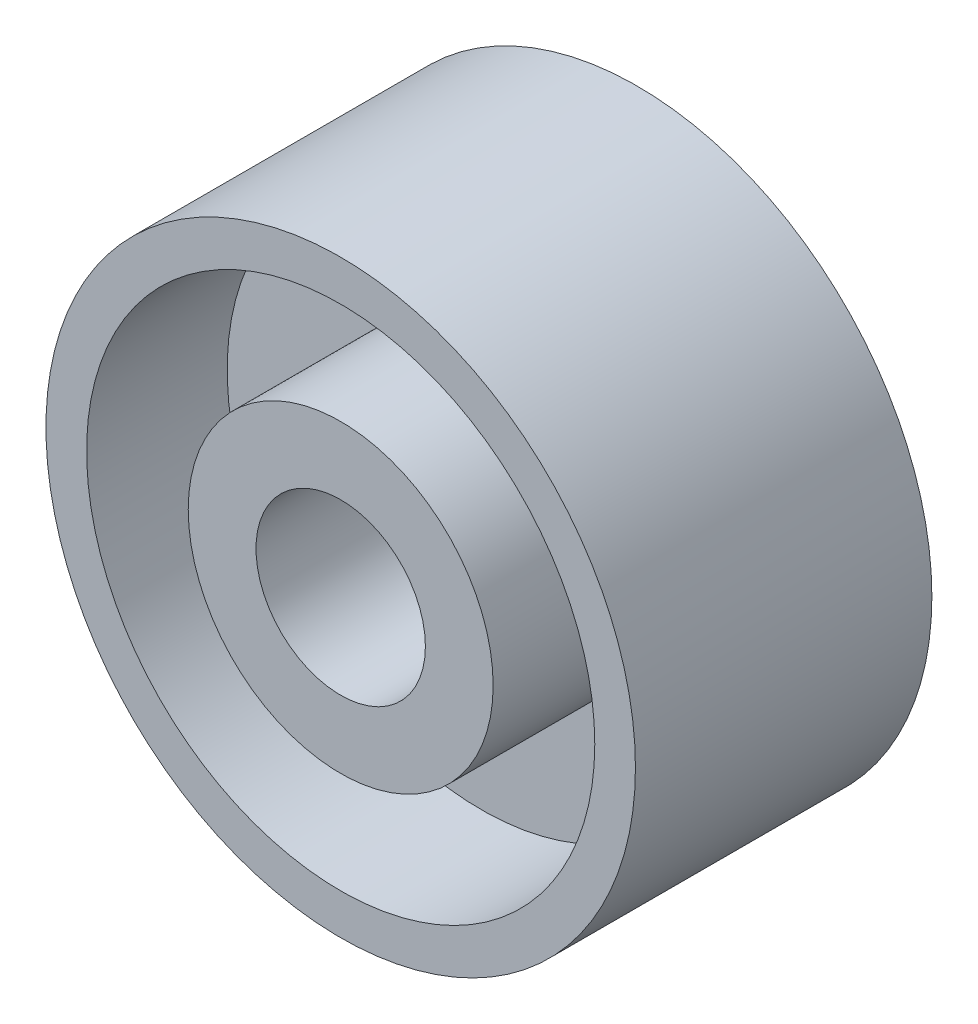
ISO-10303-21;
HEADER;
FILE_DESCRIPTION(('STEP AP214'),'2;1');
FILE_NAME('part.step','',(''),(''),'','','');
FILE_SCHEMA(('AUTOMOTIVE_DESIGN { 1 0 10303 214 1 1 1 1 }'));
ENDSEC;
DATA;
#1=APPLICATION_CONTEXT('core data for automotive mechanical design processes');
#2=APPLICATION_PROTOCOL_DEFINITION('international standard','automotive_design',2000,#1);
#3=PRODUCT_CONTEXT('',#1,'mechanical');
#4=PRODUCT('Part','Part','',(#3));
#5=PRODUCT_RELATED_PRODUCT_CATEGORY('part','',(#4));
#6=PRODUCT_DEFINITION_FORMATION('','',#4);
#7=PRODUCT_DEFINITION_CONTEXT('part definition',#1,'design');
#8=PRODUCT_DEFINITION('design','',#6,#7);
#9=PRODUCT_DEFINITION_SHAPE('','',#8);
#10=(LENGTH_UNIT() NAMED_UNIT(*) SI_UNIT(.MILLI.,.METRE.));
#11=(NAMED_UNIT(*) PLANE_ANGLE_UNIT() SI_UNIT($,.RADIAN.));
#12=(NAMED_UNIT(*) SI_UNIT($,.STERADIAN.) SOLID_ANGLE_UNIT());
#13=UNCERTAINTY_MEASURE_WITH_UNIT(LENGTH_MEASURE(1.E-05),#10,'distance_accuracy_value','');
#14=(GEOMETRIC_REPRESENTATION_CONTEXT(3) GLOBAL_UNCERTAINTY_ASSIGNED_CONTEXT((#13)) GLOBAL_UNIT_ASSIGNED_CONTEXT((#10,
#11,#12)) REPRESENTATION_CONTEXT('',''));
#15=CARTESIAN_POINT('',(0.,0.,0.));
#16=DIRECTION('',(0.,0.,1.));
#17=DIRECTION('',(1.,0.,0.));
#18=AXIS2_PLACEMENT_3D('',#15,#16,#17);
#19=CARTESIAN_POINT('',(0.,0.,0.));
#20=DIRECTION('',(0.,0.,1.));
#21=DIRECTION('',(1.,0.,0.));
#22=AXIS2_PLACEMENT_3D('',#19,#20,#21);
#23=PLANE('',#22);
#24=CARTESIAN_POINT('',(0.,0.,0.));
#25=DIRECTION('',(0.,0.,1.));
#26=DIRECTION('',(1.,0.,0.));
#27=AXIS2_PLACEMENT_3D('',#24,#25,#26);
#28=CIRCLE('',#27,0.5);
#29=CARTESIAN_POINT('',(0.5,0.,0.));
#30=VERTEX_POINT('',#29);
#31=EDGE_CURVE('E38',#30,#30,#28,.T.);
#32=ORIENTED_EDGE('',*,*,#31,.F.);
#33=EDGE_LOOP('',(#32));
#34=FACE_BOUND('',#33,.T.);
#35=CARTESIAN_POINT('',(0.,0.,0.));
#36=DIRECTION('',(0.,0.,1.));
#37=DIRECTION('',(1.,0.,0.));
#38=AXIS2_PLACEMENT_3D('',#35,#36,#37);
#39=CIRCLE('',#38,0.9);
#40=CARTESIAN_POINT('',(0.9,0.,0.));
#41=VERTEX_POINT('',#40);
#42=EDGE_CURVE('E52',#41,#41,#39,.T.);
#43=ORIENTED_EDGE('',*,*,#42,.T.);
#44=EDGE_LOOP('',(#43));
#45=FACE_BOUND('',#44,.T.);
#46=ADVANCED_FACE('F31',(#34,#45),#23,.T.);
#47=CARTESIAN_POINT('',(0.,0.,-0.875));
#48=DIRECTION('',(0.,0.,1.));
#49=DIRECTION('',(1.,0.,0.));
#50=AXIS2_PLACEMENT_3D('',#47,#48,#49);
#51=CYLINDRICAL_SURFACE('',#50,1.74);
#52=CARTESIAN_POINT('',(0.,0.,0.));
#53=DIRECTION('',(0.,0.,1.));
#54=DIRECTION('',(1.,0.,0.));
#55=AXIS2_PLACEMENT_3D('',#52,#53,#54);
#56=CIRCLE('',#55,1.74);
#57=CARTESIAN_POINT('',(1.74,0.,0.));
#58=VERTEX_POINT('',#57);
#59=EDGE_CURVE('E10',#58,#58,#56,.T.);
#60=ORIENTED_EDGE('',*,*,#59,.F.);
#61=EDGE_LOOP('',(#60));
#62=FACE_BOUND('',#61,.T.);
#63=CARTESIAN_POINT('',(0.,0.,-1.75));
#64=DIRECTION('',(0.,0.,1.));
#65=DIRECTION('',(1.,0.,0.));
#66=AXIS2_PLACEMENT_3D('',#63,#64,#65);
#67=CIRCLE('',#66,1.74);
#68=CARTESIAN_POINT('',(1.74,0.,-1.75));
#69=VERTEX_POINT('',#68);
#70=EDGE_CURVE('E54',#69,#69,#67,.T.);
#71=ORIENTED_EDGE('',*,*,#70,.T.);
#72=EDGE_LOOP('',(#71));
#73=FACE_BOUND('',#72,.T.);
#74=ADVANCED_FACE('F33',(#62,#73),#51,.T.);
#75=CARTESIAN_POINT('',(0.,0.,0.));
#76=DIRECTION('',(0.,0.,1.));
#77=DIRECTION('',(1.,0.,0.));
#78=AXIS2_PLACEMENT_3D('',#75,#76,#77);
#79=CIRCLE('',#78,1.5);
#80=CARTESIAN_POINT('',(1.5,0.,0.));
#81=VERTEX_POINT('',#80);
#82=EDGE_CURVE('E49',#81,#81,#79,.T.);
#83=ORIENTED_EDGE('',*,*,#82,.F.);
#84=EDGE_LOOP('',(#83));
#85=FACE_BOUND('',#84,.T.);
#86=ORIENTED_EDGE('',*,*,#59,.T.);
#87=EDGE_LOOP('',(#86));
#88=FACE_BOUND('',#87,.T.);
#89=ADVANCED_FACE('F102',(#85,#88),#23,.T.);
#90=CARTESIAN_POINT('',(0.,0.,-0.875));
#91=DIRECTION('',(0.,0.,1.));
#92=DIRECTION('',(1.,0.,0.));
#93=AXIS2_PLACEMENT_3D('',#90,#91,#92);
#94=CYLINDRICAL_SURFACE('',#93,0.5);
#95=ORIENTED_EDGE('',*,*,#31,.T.);
#96=EDGE_LOOP('',(#95));
#97=FACE_BOUND('',#96,.T.);
#98=CARTESIAN_POINT('',(0.,0.,-1.75));
#99=DIRECTION('',(0.,0.,1.));
#100=DIRECTION('',(1.,0.,0.));
#101=AXIS2_PLACEMENT_3D('',#98,#99,#100);
#102=CIRCLE('',#101,0.5);
#103=CARTESIAN_POINT('',(0.5,0.,-1.75));
#104=VERTEX_POINT('',#103);
#105=EDGE_CURVE('E60',#104,#104,#102,.T.);
#106=ORIENTED_EDGE('',*,*,#105,.F.);
#107=EDGE_LOOP('',(#106));
#108=FACE_BOUND('',#107,.T.);
#109=ADVANCED_FACE('F110',(#97,#108),#94,.F.);
#110=CARTESIAN_POINT('',(0.,0.,-0.83));
#111=DIRECTION('',(0.,0.,1.));
#112=DIRECTION('',(1.,0.,0.));
#113=AXIS2_PLACEMENT_3D('',#110,#111,#112);
#114=CYLINDRICAL_SURFACE('',#113,0.9);
#115=CARTESIAN_POINT('',(0.,0.,-0.83));
#116=DIRECTION('',(0.,0.,1.));
#117=DIRECTION('',(1.,0.,0.));
#118=AXIS2_PLACEMENT_3D('',#115,#116,#117);
#119=CIRCLE('',#118,0.9);
#120=CARTESIAN_POINT('',(0.9,0.,-0.83));
#121=VERTEX_POINT('',#120);
#122=EDGE_CURVE('E46',#121,#121,#119,.T.);
#123=ORIENTED_EDGE('',*,*,#122,.T.);
#124=EDGE_LOOP('',(#123));
#125=FACE_BOUND('',#124,.T.);
#126=ORIENTED_EDGE('',*,*,#42,.F.);
#127=EDGE_LOOP('',(#126));
#128=FACE_BOUND('',#127,.T.);
#129=ADVANCED_FACE('F115',(#125,#128),#114,.T.);
#130=CARTESIAN_POINT('',(0.,0.,-0.83));
#131=DIRECTION('',(0.,0.,1.));
#132=DIRECTION('',(1.,0.,0.));
#133=AXIS2_PLACEMENT_3D('',#130,#131,#132);
#134=CYLINDRICAL_SURFACE('',#133,1.5);
#135=CARTESIAN_POINT('',(0.,0.,-0.83));
#136=DIRECTION('',(0.,0.,1.));
#137=DIRECTION('',(1.,0.,0.));
#138=AXIS2_PLACEMENT_3D('',#135,#136,#137);
#139=CIRCLE('',#138,1.5);
#140=CARTESIAN_POINT('',(1.5,0.,-0.83));
#141=VERTEX_POINT('',#140);
#142=EDGE_CURVE('E42',#141,#141,#139,.T.);
#143=ORIENTED_EDGE('',*,*,#142,.F.);
#144=EDGE_LOOP('',(#143));
#145=FACE_BOUND('',#144,.T.);
#146=ORIENTED_EDGE('',*,*,#82,.T.);
#147=EDGE_LOOP('',(#146));
#148=FACE_BOUND('',#147,.T.);
#149=ADVANCED_FACE('F97',(#145,#148),#134,.F.);
#150=CARTESIAN_POINT('',(0.,0.,-0.83));
#151=DIRECTION('',(0.,0.,1.));
#152=DIRECTION('',(1.,0.,0.));
#153=AXIS2_PLACEMENT_3D('',#150,#151,#152);
#154=PLANE('',#153);
#155=ORIENTED_EDGE('',*,*,#122,.F.);
#156=EDGE_LOOP('',(#155));
#157=FACE_BOUND('',#156,.T.);
#158=ORIENTED_EDGE('',*,*,#142,.T.);
#159=EDGE_LOOP('',(#158));
#160=FACE_BOUND('',#159,.T.);
#161=ADVANCED_FACE('F89',(#157,#160),#154,.T.);
#162=CARTESIAN_POINT('',(0.,0.,-1.75));
#163=DIRECTION('',(0.,0.,-1.));
#164=DIRECTION('',(1.,0.,0.));
#165=AXIS2_PLACEMENT_3D('',#162,#163,#164);
#166=PLANE('',#165);
#167=ORIENTED_EDGE('',*,*,#105,.T.);
#168=EDGE_LOOP('',(#167));
#169=FACE_BOUND('',#168,.T.);
#170=CARTESIAN_POINT('',(0.,0.,-1.75));
#171=DIRECTION('',(0.,0.,1.));
#172=DIRECTION('',(1.,0.,0.));
#173=AXIS2_PLACEMENT_3D('',#170,#171,#172);
#174=CIRCLE('',#173,0.9);
#175=CARTESIAN_POINT('',(0.9,0.,-1.75));
#176=VERTEX_POINT('',#175);
#177=EDGE_CURVE('E68',#176,#176,#174,.T.);
#178=ORIENTED_EDGE('',*,*,#177,.F.);
#179=EDGE_LOOP('',(#178));
#180=FACE_BOUND('',#179,.T.);
#181=ADVANCED_FACE('F87',(#169,#180),#166,.T.);
#182=CARTESIAN_POINT('',(0.,0.,-1.75));
#183=DIRECTION('',(0.,0.,1.));
#184=DIRECTION('',(1.,0.,0.));
#185=AXIS2_PLACEMENT_3D('',#182,#183,#184);
#186=CIRCLE('',#185,1.5);
#187=CARTESIAN_POINT('',(1.5,0.,-1.75));
#188=VERTEX_POINT('',#187);
#189=EDGE_CURVE('E64',#188,#188,#186,.T.);
#190=ORIENTED_EDGE('',*,*,#189,.T.);
#191=EDGE_LOOP('',(#190));
#192=FACE_BOUND('',#191,.T.);
#193=ORIENTED_EDGE('',*,*,#70,.F.);
#194=EDGE_LOOP('',(#193));
#195=FACE_BOUND('',#194,.T.);
#196=ADVANCED_FACE('F83',(#192,#195),#166,.T.);
#197=CARTESIAN_POINT('',(0.,0.,-0.92));
#198=DIRECTION('',(0.,0.,-1.));
#199=DIRECTION('',(1.,0.,0.));
#200=AXIS2_PLACEMENT_3D('',#197,#198,#199);
#201=CYLINDRICAL_SURFACE('',#200,0.9);
#202=CARTESIAN_POINT('',(0.,0.,-0.92));
#203=DIRECTION('',(0.,0.,1.));
#204=DIRECTION('',(1.,0.,0.));
#205=AXIS2_PLACEMENT_3D('',#202,#203,#204);
#206=CIRCLE('',#205,0.9);
#207=CARTESIAN_POINT('',(0.9,0.,-0.92));
#208=VERTEX_POINT('',#207);
#209=EDGE_CURVE('E67',#208,#208,#206,.T.);
#210=ORIENTED_EDGE('',*,*,#209,.F.);
#211=EDGE_LOOP('',(#210));
#212=FACE_BOUND('',#211,.T.);
#213=ORIENTED_EDGE('',*,*,#177,.T.);
#214=EDGE_LOOP('',(#213));
#215=FACE_BOUND('',#214,.T.);
#216=ADVANCED_FACE('F79',(#212,#215),#201,.T.);
#217=CARTESIAN_POINT('',(0.,0.,-0.92));
#218=DIRECTION('',(0.,0.,-1.));
#219=DIRECTION('',(1.,0.,0.));
#220=AXIS2_PLACEMENT_3D('',#217,#218,#219);
#221=CYLINDRICAL_SURFACE('',#220,1.5);
#222=CARTESIAN_POINT('',(0.,0.,-0.92));
#223=DIRECTION('',(0.,0.,1.));
#224=DIRECTION('',(1.,0.,0.));
#225=AXIS2_PLACEMENT_3D('',#222,#223,#224);
#226=CIRCLE('',#225,1.5);
#227=CARTESIAN_POINT('',(1.5,0.,-0.92));
#228=VERTEX_POINT('',#227);
#229=EDGE_CURVE('E63',#228,#228,#226,.T.);
#230=ORIENTED_EDGE('',*,*,#229,.T.);
#231=EDGE_LOOP('',(#230));
#232=FACE_BOUND('',#231,.T.);
#233=ORIENTED_EDGE('',*,*,#189,.F.);
#234=EDGE_LOOP('',(#233));
#235=FACE_BOUND('',#234,.T.);
#236=ADVANCED_FACE('F82',(#232,#235),#221,.F.);
#237=CARTESIAN_POINT('',(0.,0.,-0.92));
#238=DIRECTION('',(0.,0.,-1.));
#239=DIRECTION('',(1.,0.,0.));
#240=AXIS2_PLACEMENT_3D('',#237,#238,#239);
#241=PLANE('',#240);
#242=ORIENTED_EDGE('',*,*,#209,.T.);
#243=EDGE_LOOP('',(#242));
#244=FACE_BOUND('',#243,.T.);
#245=ORIENTED_EDGE('',*,*,#229,.F.);
#246=EDGE_LOOP('',(#245));
#247=FACE_BOUND('',#246,.T.);
#248=ADVANCED_FACE('F76',(#244,#247),#241,.T.);
#249=CLOSED_SHELL('',(#46,#74,#89,#109,#129,#149,#161,#181,#196,#216,#236,#248));
#250=MANIFOLD_SOLID_BREP('B2',#249);
#251=ADVANCED_BREP_SHAPE_REPRESENTATION('',(#18,#250),#14);
#252=SHAPE_DEFINITION_REPRESENTATION(#9,#251);
ENDSEC;
END-ISO-10303-21;
